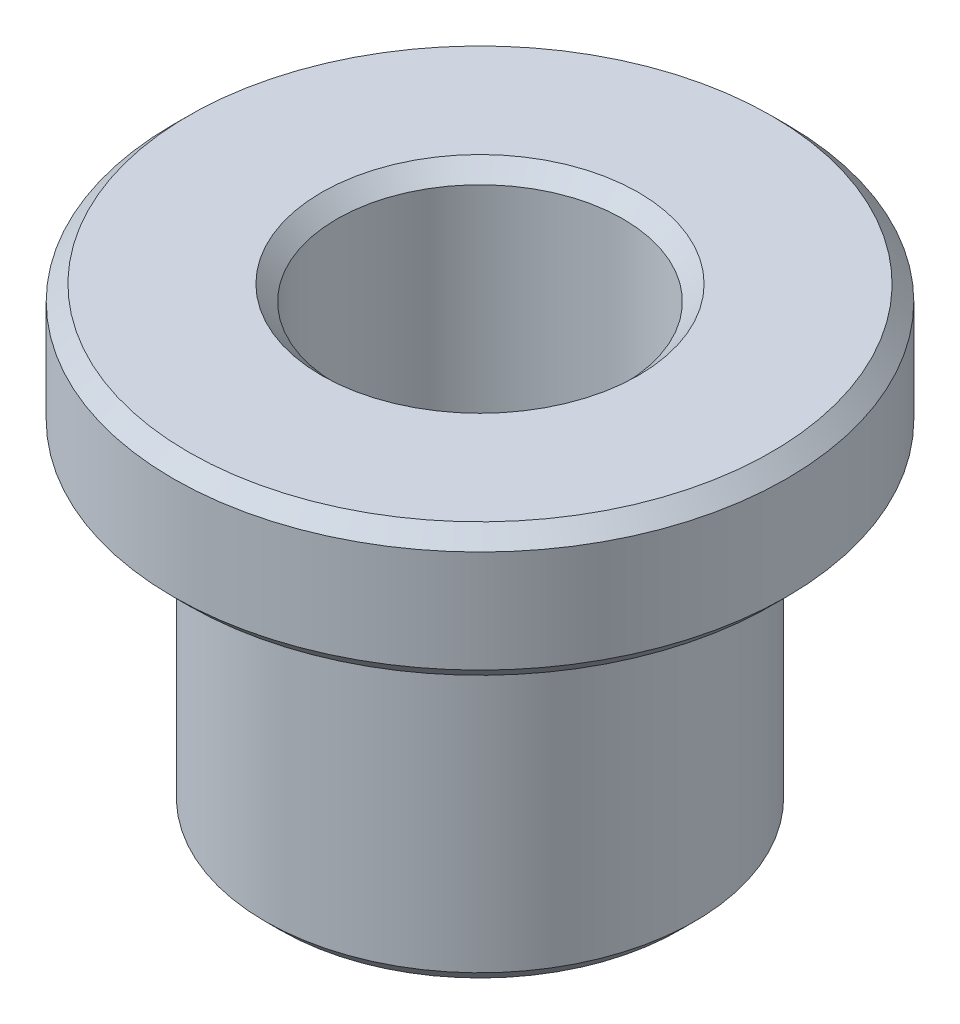
ISO-10303-21;
HEADER;
FILE_DESCRIPTION(('STEP AP214'),'2;1');
FILE_NAME('part.step','',(''),(''),'','','');
FILE_SCHEMA(('AUTOMOTIVE_DESIGN { 1 0 10303 214 1 1 1 1 }'));
ENDSEC;
DATA;
#1=APPLICATION_CONTEXT('core data for automotive mechanical design processes');
#2=APPLICATION_PROTOCOL_DEFINITION('international standard','automotive_design',2000,#1);
#3=PRODUCT_CONTEXT('',#1,'mechanical');
#4=PRODUCT('Part','Part','',(#3));
#5=PRODUCT_RELATED_PRODUCT_CATEGORY('part','',(#4));
#6=PRODUCT_DEFINITION_FORMATION('','',#4);
#7=PRODUCT_DEFINITION_CONTEXT('part definition',#1,'design');
#8=PRODUCT_DEFINITION('design','',#6,#7);
#9=PRODUCT_DEFINITION_SHAPE('','',#8);
#10=(LENGTH_UNIT() NAMED_UNIT(*) SI_UNIT(.MILLI.,.METRE.));
#11=(NAMED_UNIT(*) PLANE_ANGLE_UNIT() SI_UNIT($,.RADIAN.));
#12=(NAMED_UNIT(*) SI_UNIT($,.STERADIAN.) SOLID_ANGLE_UNIT());
#13=UNCERTAINTY_MEASURE_WITH_UNIT(LENGTH_MEASURE(1.E-05),#10,'distance_accuracy_value','');
#14=(GEOMETRIC_REPRESENTATION_CONTEXT(3) GLOBAL_UNCERTAINTY_ASSIGNED_CONTEXT((#13)) GLOBAL_UNIT_ASSIGNED_CONTEXT((#10,
#11,#12)) REPRESENTATION_CONTEXT('',''));
#15=CARTESIAN_POINT('',(0.,0.,0.));
#16=DIRECTION('',(0.,0.,1.));
#17=DIRECTION('',(1.,0.,0.));
#18=AXIS2_PLACEMENT_3D('',#15,#16,#17);
#19=CARTESIAN_POINT('',(0.,32.,0.));
#20=DIRECTION('',(0.,-1.,0.));
#21=DIRECTION('',(0.,0.,-1.));
#22=AXIS2_PLACEMENT_3D('',#19,#20,#21);
#23=CYLINDRICAL_SURFACE('',#22,21.);
#24=CARTESIAN_POINT('',(0.,1.5,0.));
#25=DIRECTION('',(0.,1.,0.));
#26=DIRECTION('',(0.,0.,1.));
#27=AXIS2_PLACEMENT_3D('',#24,#25,#26);
#28=CIRCLE('',#27,21.);
#29=CARTESIAN_POINT('',(0.,1.5,21.));
#30=VERTEX_POINT('',#29);
#31=EDGE_CURVE('E63',#30,#30,#28,.T.);
#32=ORIENTED_EDGE('',*,*,#31,.T.);
#33=EDGE_LOOP('',(#32));
#34=FACE_BOUND('',#33,.T.);
#35=CARTESIAN_POINT('',(0.,32.,0.));
#36=DIRECTION('',(0.,1.,0.));
#37=DIRECTION('',(0.,0.,1.));
#38=AXIS2_PLACEMENT_3D('',#35,#36,#37);
#39=CIRCLE('',#38,21.);
#40=CARTESIAN_POINT('',(0.,32.,21.));
#41=VERTEX_POINT('',#40);
#42=EDGE_CURVE('E78',#41,#41,#39,.T.);
#43=ORIENTED_EDGE('',*,*,#42,.F.);
#44=EDGE_LOOP('',(#43));
#45=FACE_BOUND('',#44,.T.);
#46=ADVANCED_FACE('F39',(#34,#45),#23,.T.);
#47=CARTESIAN_POINT('',(0.,0.,0.));
#48=DIRECTION('',(0.,1.,0.));
#49=DIRECTION('',(0.,0.,1.));
#50=AXIS2_PLACEMENT_3D('',#47,#48,#49);
#51=PLANE('',#50);
#52=CARTESIAN_POINT('',(0.,0.,0.));
#53=DIRECTION('',(0.,1.,0.));
#54=DIRECTION('',(0.,0.,1.));
#55=AXIS2_PLACEMENT_3D('',#52,#53,#54);
#56=CIRCLE('',#55,15.5);
#57=CARTESIAN_POINT('',(0.,0.,15.5));
#58=VERTEX_POINT('',#57);
#59=EDGE_CURVE('E72',#58,#58,#56,.T.);
#60=ORIENTED_EDGE('',*,*,#59,.T.);
#61=EDGE_LOOP('',(#60));
#62=FACE_BOUND('',#61,.T.);
#63=CARTESIAN_POINT('',(0.,0.,0.));
#64=DIRECTION('',(0.,1.,0.));
#65=DIRECTION('',(0.,0.,1.));
#66=AXIS2_PLACEMENT_3D('',#63,#64,#65);
#67=CIRCLE('',#66,19.5);
#68=CARTESIAN_POINT('',(0.,0.,19.5));
#69=VERTEX_POINT('',#68);
#70=EDGE_CURVE('E75',#69,#69,#67,.F.);
#71=ORIENTED_EDGE('',*,*,#70,.T.);
#72=EDGE_LOOP('',(#71));
#73=FACE_BOUND('',#72,.T.);
#74=ADVANCED_FACE('F85',(#62,#73),#51,.F.);
#75=CARTESIAN_POINT('',(0.,45.,0.));
#76=DIRECTION('',(0.,-1.,0.));
#77=DIRECTION('',(0.,0.,-1.));
#78=AXIS2_PLACEMENT_3D('',#75,#76,#77);
#79=CYLINDRICAL_SURFACE('',#78,30.);
#80=CARTESIAN_POINT('',(0.,33.5,0.));
#81=DIRECTION('',(0.,1.,0.));
#82=DIRECTION('',(0.,0.,1.));
#83=AXIS2_PLACEMENT_3D('',#80,#81,#82);
#84=CIRCLE('',#83,30.);
#85=CARTESIAN_POINT('',(0.,33.5,30.));
#86=VERTEX_POINT('',#85);
#87=EDGE_CURVE('E55',#86,#86,#84,.T.);
#88=ORIENTED_EDGE('',*,*,#87,.T.);
#89=EDGE_LOOP('',(#88));
#90=FACE_BOUND('',#89,.T.);
#91=CARTESIAN_POINT('',(0.,43.5000000000001,0.));
#92=DIRECTION('',(0.,1.,0.));
#93=DIRECTION('',(0.,0.,1.));
#94=AXIS2_PLACEMENT_3D('',#91,#92,#93);
#95=CIRCLE('',#94,30.);
#96=CARTESIAN_POINT('',(0.,43.5000000000001,30.));
#97=VERTEX_POINT('',#96);
#98=EDGE_CURVE('E60',#97,#97,#95,.F.);
#99=ORIENTED_EDGE('',*,*,#98,.T.);
#100=EDGE_LOOP('',(#99));
#101=FACE_BOUND('',#100,.T.);
#102=ADVANCED_FACE('F91',(#90,#101),#79,.T.);
#103=CARTESIAN_POINT('',(0.,45.,0.));
#104=DIRECTION('',(0.,1.,0.));
#105=DIRECTION('',(0.,0.,1.));
#106=AXIS2_PLACEMENT_3D('',#103,#104,#105);
#107=PLANE('',#106);
#108=CARTESIAN_POINT('',(0.,45.,0.));
#109=DIRECTION('',(0.,1.,0.));
#110=DIRECTION('',(0.,0.,1.));
#111=AXIS2_PLACEMENT_3D('',#108,#109,#110);
#112=CIRCLE('',#111,28.5000000000001);
#113=CARTESIAN_POINT('',(0.,45.,28.5000000000001));
#114=VERTEX_POINT('',#113);
#115=EDGE_CURVE('E10',#114,#114,#112,.T.);
#116=ORIENTED_EDGE('',*,*,#115,.T.);
#117=EDGE_LOOP('',(#116));
#118=FACE_BOUND('',#117,.T.);
#119=CARTESIAN_POINT('',(0.,45.,0.));
#120=DIRECTION('',(0.,1.,0.));
#121=DIRECTION('',(0.,0.,1.));
#122=AXIS2_PLACEMENT_3D('',#119,#120,#121);
#123=CIRCLE('',#122,15.5);
#124=CARTESIAN_POINT('',(0.,45.,15.5));
#125=VERTEX_POINT('',#124);
#126=EDGE_CURVE('E47',#125,#125,#123,.F.);
#127=ORIENTED_EDGE('',*,*,#126,.T.);
#128=EDGE_LOOP('',(#127));
#129=FACE_BOUND('',#128,.T.);
#130=ADVANCED_FACE('F131',(#118,#129),#107,.T.);
#131=CARTESIAN_POINT('',(0.,32.,0.));
#132=DIRECTION('',(0.,1.,0.));
#133=DIRECTION('',(0.,0.,1.));
#134=AXIS2_PLACEMENT_3D('',#131,#132,#133);
#135=PLANE('',#134);
#136=CARTESIAN_POINT('',(0.,32.,0.));
#137=DIRECTION('',(0.,1.,0.));
#138=DIRECTION('',(0.,0.,1.));
#139=AXIS2_PLACEMENT_3D('',#136,#137,#138);
#140=CIRCLE('',#139,28.5);
#141=CARTESIAN_POINT('',(0.,32.,28.5));
#142=VERTEX_POINT('',#141);
#143=EDGE_CURVE('E51',#142,#142,#140,.F.);
#144=ORIENTED_EDGE('',*,*,#143,.T.);
#145=EDGE_LOOP('',(#144));
#146=FACE_BOUND('',#145,.T.);
#147=ORIENTED_EDGE('',*,*,#42,.T.);
#148=EDGE_LOOP('',(#147));
#149=FACE_BOUND('',#148,.T.);
#150=ADVANCED_FACE('F82',(#146,#149),#135,.F.);
#151=CARTESIAN_POINT('',(0.,0.,0.));
#152=DIRECTION('',(0.,1.,0.));
#153=DIRECTION('',(0.,0.,1.));
#154=AXIS2_PLACEMENT_3D('',#151,#152,#153);
#155=CYLINDRICAL_SURFACE('',#154,14.);
#156=CARTESIAN_POINT('',(0.,1.49999999999997,0.));
#157=DIRECTION('',(0.,1.,0.));
#158=DIRECTION('',(0.,0.,1.));
#159=AXIS2_PLACEMENT_3D('',#156,#157,#158);
#160=CIRCLE('',#159,14.);
#161=CARTESIAN_POINT('',(0.,1.49999999999997,14.));
#162=VERTEX_POINT('',#161);
#163=EDGE_CURVE('E66',#162,#162,#160,.F.);
#164=ORIENTED_EDGE('',*,*,#163,.T.);
#165=EDGE_LOOP('',(#164));
#166=FACE_BOUND('',#165,.T.);
#167=CARTESIAN_POINT('',(0.,43.5,0.));
#168=DIRECTION('',(0.,1.,0.));
#169=DIRECTION('',(0.,0.,1.));
#170=AXIS2_PLACEMENT_3D('',#167,#168,#169);
#171=CIRCLE('',#170,14.);
#172=CARTESIAN_POINT('',(0.,43.5,14.));
#173=VERTEX_POINT('',#172);
#174=EDGE_CURVE('E69',#173,#173,#171,.T.);
#175=ORIENTED_EDGE('',*,*,#174,.T.);
#176=EDGE_LOOP('',(#175));
#177=FACE_BOUND('',#176,.T.);
#178=ADVANCED_FACE('F104',(#166,#177),#155,.F.);
#179=CARTESIAN_POINT('',(0.,0.,0.));
#180=DIRECTION('',(0.,-1.,0.));
#181=DIRECTION('',(0.,0.,-1.));
#182=AXIS2_PLACEMENT_3D('',#179,#180,#181);
#183=CONICAL_SURFACE('',#182,15.5,0.785398163397448);
#184=ORIENTED_EDGE('',*,*,#163,.F.);
#185=EDGE_LOOP('',(#184));
#186=FACE_BOUND('',#185,.T.);
#187=ORIENTED_EDGE('',*,*,#59,.F.);
#188=EDGE_LOOP('',(#187));
#189=FACE_BOUND('',#188,.T.);
#190=ADVANCED_FACE('F97',(#186,#189),#183,.F.);
#191=CARTESIAN_POINT('',(0.,1.5,0.));
#192=DIRECTION('',(0.,1.,0.));
#193=DIRECTION('',(0.,0.,1.));
#194=AXIS2_PLACEMENT_3D('',#191,#192,#193);
#195=CONICAL_SURFACE('',#194,21.,0.785398163397448);
#196=ORIENTED_EDGE('',*,*,#70,.F.);
#197=EDGE_LOOP('',(#196));
#198=FACE_BOUND('',#197,.T.);
#199=ORIENTED_EDGE('',*,*,#31,.F.);
#200=EDGE_LOOP('',(#199));
#201=FACE_BOUND('',#200,.T.);
#202=ADVANCED_FACE('F103',(#198,#201),#195,.T.);
#203=CARTESIAN_POINT('',(0.,33.5,0.));
#204=DIRECTION('',(0.,1.,0.));
#205=DIRECTION('',(0.,0.,1.));
#206=AXIS2_PLACEMENT_3D('',#203,#204,#205);
#207=CONICAL_SURFACE('',#206,30.,0.785398163397455);
#208=ORIENTED_EDGE('',*,*,#143,.F.);
#209=EDGE_LOOP('',(#208));
#210=FACE_BOUND('',#209,.T.);
#211=ORIENTED_EDGE('',*,*,#87,.F.);
#212=EDGE_LOOP('',(#211));
#213=FACE_BOUND('',#212,.T.);
#214=ADVANCED_FACE('F111',(#210,#213),#207,.T.);
#215=CARTESIAN_POINT('',(0.,45.,0.));
#216=DIRECTION('',(0.,-1.,0.));
#217=DIRECTION('',(0.,0.,-1.));
#218=AXIS2_PLACEMENT_3D('',#215,#216,#217);
#219=CONICAL_SURFACE('',#218,28.5000000000001,0.785398163397447);
#220=ORIENTED_EDGE('',*,*,#98,.F.);
#221=EDGE_LOOP('',(#220));
#222=FACE_BOUND('',#221,.T.);
#223=ORIENTED_EDGE('',*,*,#115,.F.);
#224=EDGE_LOOP('',(#223));
#225=FACE_BOUND('',#224,.T.);
#226=ADVANCED_FACE('F117',(#222,#225),#219,.T.);
#227=CARTESIAN_POINT('',(0.,43.5,0.));
#228=DIRECTION('',(0.,1.,0.));
#229=DIRECTION('',(0.,0.,1.));
#230=AXIS2_PLACEMENT_3D('',#227,#228,#229);
#231=CONICAL_SURFACE('',#230,14.,0.785398163397449);
#232=ORIENTED_EDGE('',*,*,#126,.F.);
#233=EDGE_LOOP('',(#232));
#234=FACE_BOUND('',#233,.T.);
#235=ORIENTED_EDGE('',*,*,#174,.F.);
#236=EDGE_LOOP('',(#235));
#237=FACE_BOUND('',#236,.T.);
#238=ADVANCED_FACE('F42',(#234,#237),#231,.F.);
#239=CLOSED_SHELL('',(#46,#74,#102,#130,#150,#178,#190,#202,#214,#226,#238));
#240=MANIFOLD_SOLID_BREP('B2',#239);
#241=ADVANCED_BREP_SHAPE_REPRESENTATION('',(#18,#240),#14);
#242=SHAPE_DEFINITION_REPRESENTATION(#9,#241);
ENDSEC;
END-ISO-10303-21;
